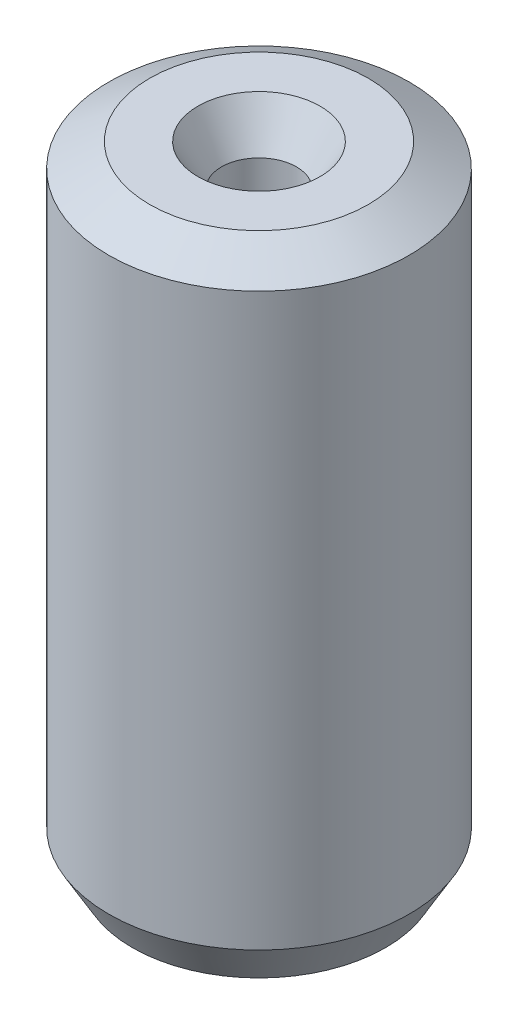
ISO-10303-21;
HEADER;
FILE_DESCRIPTION(('STEP AP214'),'2;1');
FILE_NAME('part.step','',(''),(''),'','','');
FILE_SCHEMA(('AUTOMOTIVE_DESIGN { 1 0 10303 214 1 1 1 1 }'));
ENDSEC;
DATA;
#1=APPLICATION_CONTEXT('core data for automotive mechanical design processes');
#2=APPLICATION_PROTOCOL_DEFINITION('international standard','automotive_design',2000,#1);
#3=PRODUCT_CONTEXT('',#1,'mechanical');
#4=PRODUCT('Part','Part','',(#3));
#5=PRODUCT_RELATED_PRODUCT_CATEGORY('part','',(#4));
#6=PRODUCT_DEFINITION_FORMATION('','',#4);
#7=PRODUCT_DEFINITION_CONTEXT('part definition',#1,'design');
#8=PRODUCT_DEFINITION('design','',#6,#7);
#9=PRODUCT_DEFINITION_SHAPE('','',#8);
#10=(LENGTH_UNIT() NAMED_UNIT(*) SI_UNIT(.MILLI.,.METRE.));
#11=(NAMED_UNIT(*) PLANE_ANGLE_UNIT() SI_UNIT($,.RADIAN.));
#12=(NAMED_UNIT(*) SI_UNIT($,.STERADIAN.) SOLID_ANGLE_UNIT());
#13=UNCERTAINTY_MEASURE_WITH_UNIT(LENGTH_MEASURE(1.E-05),#10,'distance_accuracy_value','');
#14=(GEOMETRIC_REPRESENTATION_CONTEXT(3) GLOBAL_UNCERTAINTY_ASSIGNED_CONTEXT((#13)) GLOBAL_UNIT_ASSIGNED_CONTEXT((#10,
#11,#12)) REPRESENTATION_CONTEXT('',''));
#15=CARTESIAN_POINT('',(0.,0.,0.));
#16=DIRECTION('',(0.,0.,1.));
#17=DIRECTION('',(1.,0.,0.));
#18=AXIS2_PLACEMENT_3D('',#15,#16,#17);
#19=CARTESIAN_POINT('',(0.,21.140414715979,0.));
#20=DIRECTION('',(0.,-1.,0.));
#21=DIRECTION('',(0.,0.,-1.));
#22=AXIS2_PLACEMENT_3D('',#19,#20,#21);
#23=CYLINDRICAL_SURFACE('',#22,5.);
#24=CARTESIAN_POINT('',(0.,1.35913423101517,0.));
#25=DIRECTION('',(0.,1.,0.));
#26=DIRECTION('',(0.,0.,1.));
#27=AXIS2_PLACEMENT_3D('',#24,#25,#26);
#28=CIRCLE('',#27,5.);
#29=CARTESIAN_POINT('',(0.,1.35913423101517,5.));
#30=VERTEX_POINT('',#29);
#31=EDGE_CURVE('E10',#30,#30,#28,.T.);
#32=ORIENTED_EDGE('',*,*,#31,.T.);
#33=EDGE_LOOP('',(#32));
#34=FACE_BOUND('',#33,.T.);
#35=CARTESIAN_POINT('',(0.,20.3557182018375,0.));
#36=DIRECTION('',(0.,1.,0.));
#37=DIRECTION('',(0.,0.,1.));
#38=AXIS2_PLACEMENT_3D('',#35,#36,#37);
#39=CIRCLE('',#38,5.);
#40=CARTESIAN_POINT('',(0.,20.3557182018375,5.));
#41=VERTEX_POINT('',#40);
#42=EDGE_CURVE('E50',#41,#41,#39,.F.);
#43=ORIENTED_EDGE('',*,*,#42,.T.);
#44=EDGE_LOOP('',(#43));
#45=FACE_BOUND('',#44,.T.);
#46=ADVANCED_FACE('F39',(#34,#45),#23,.T.);
#47=CARTESIAN_POINT('',(0.,21.140414715979,0.));
#48=DIRECTION('',(0.,1.,0.));
#49=DIRECTION('',(0.,0.,1.));
#50=AXIS2_PLACEMENT_3D('',#47,#48,#49);
#51=PLANE('',#50);
#52=CARTESIAN_POINT('',(0.,21.140414715979,0.));
#53=DIRECTION('',(0.,1.,0.));
#54=DIRECTION('',(0.,0.,1.));
#55=AXIS2_PLACEMENT_3D('',#52,#53,#54);
#56=CIRCLE('',#55,2.03417617700209);
#57=CARTESIAN_POINT('',(0.,21.140414715979,2.03417617700209));
#58=VERTEX_POINT('',#57);
#59=EDGE_CURVE('E58',#58,#58,#56,.F.);
#60=ORIENTED_EDGE('',*,*,#59,.T.);
#61=EDGE_LOOP('',(#60));
#62=FACE_BOUND('',#61,.T.);
#63=CARTESIAN_POINT('',(0.,21.140414715979,0.));
#64=DIRECTION('',(0.,1.,0.));
#65=DIRECTION('',(0.,0.,1.));
#66=AXIS2_PLACEMENT_3D('',#63,#64,#65);
#67=CIRCLE('',#66,3.64086576898482);
#68=CARTESIAN_POINT('',(0.,21.140414715979,3.64086576898482));
#69=VERTEX_POINT('',#68);
#70=EDGE_CURVE('E61',#69,#69,#67,.T.);
#71=ORIENTED_EDGE('',*,*,#70,.T.);
#72=EDGE_LOOP('',(#71));
#73=FACE_BOUND('',#72,.T.);
#74=ADVANCED_FACE('F88',(#62,#73),#51,.T.);
#75=CARTESIAN_POINT('',(0.,0.,0.));
#76=DIRECTION('',(0.,1.,0.));
#77=DIRECTION('',(0.,0.,1.));
#78=AXIS2_PLACEMENT_3D('',#75,#76,#77);
#79=PLANE('',#78);
#80=CARTESIAN_POINT('',(0.,0.,0.));
#81=DIRECTION('',(0.,1.,0.));
#82=DIRECTION('',(0.,0.,1.));
#83=AXIS2_PLACEMENT_3D('',#80,#81,#82);
#84=CIRCLE('',#83,2.60861389387581);
#85=CARTESIAN_POINT('',(0.,0.,-2.60861389387581));
#86=VERTEX_POINT('',#85);
#87=EDGE_CURVE('E51',#86,#86,#84,.T.);
#88=ORIENTED_EDGE('',*,*,#87,.T.);
#89=EDGE_LOOP('',(#88));
#90=FACE_BOUND('',#89,.T.);
#91=CARTESIAN_POINT('',(0.,0.,0.));
#92=DIRECTION('',(0.,1.,0.));
#93=DIRECTION('',(0.,0.,1.));
#94=AXIS2_PLACEMENT_3D('',#91,#92,#93);
#95=CIRCLE('',#94,4.21530348585855);
#96=CARTESIAN_POINT('',(0.,0.,4.21530348585855));
#97=VERTEX_POINT('',#96);
#98=EDGE_CURVE('E54',#97,#97,#95,.F.);
#99=ORIENTED_EDGE('',*,*,#98,.T.);
#100=EDGE_LOOP('',(#99));
#101=FACE_BOUND('',#100,.T.);
#102=ADVANCED_FACE('F83',(#90,#101),#79,.F.);
#103=CARTESIAN_POINT('',(0.,21.140414715979,0.));
#104=DIRECTION('',(0.,-1.,0.));
#105=DIRECTION('',(0.,0.,-1.));
#106=AXIS2_PLACEMENT_3D('',#103,#104,#105);
#107=CYLINDRICAL_SURFACE('',#106,1.24947966286064);
#108=CARTESIAN_POINT('',(0.,19.7812804849638,0.));
#109=DIRECTION('',(0.,1.,0.));
#110=DIRECTION('',(0.,0.,1.));
#111=AXIS2_PLACEMENT_3D('',#108,#109,#110);
#112=CIRCLE('',#111,1.24947966286064);
#113=CARTESIAN_POINT('',(0.,19.7812804849638,1.24947966286064));
#114=VERTEX_POINT('',#113);
#115=EDGE_CURVE('E67',#114,#114,#112,.T.);
#116=ORIENTED_EDGE('',*,*,#115,.T.);
#117=EDGE_LOOP('',(#116));
#118=FACE_BOUND('',#117,.T.);
#119=CARTESIAN_POINT('',(0.,0.784696514141453,0.));
#120=DIRECTION('',(0.,1.,0.));
#121=DIRECTION('',(0.,0.,1.));
#122=AXIS2_PLACEMENT_3D('',#119,#120,#121);
#123=CIRCLE('',#122,1.24947966286064);
#124=CARTESIAN_POINT('',(0.,0.784696514141453,-1.24947966286064));
#125=VERTEX_POINT('',#124);
#126=EDGE_CURVE('E69',#125,#125,#123,.F.);
#127=ORIENTED_EDGE('',*,*,#126,.T.);
#128=EDGE_LOOP('',(#127));
#129=FACE_BOUND('',#128,.T.);
#130=ADVANCED_FACE('F71',(#118,#129),#107,.F.);
#131=CARTESIAN_POINT('',(0.,19.7812804849638,0.));
#132=DIRECTION('',(0.,1.,0.));
#133=DIRECTION('',(0.,0.,1.));
#134=AXIS2_PLACEMENT_3D('',#131,#132,#133);
#135=CONICAL_SURFACE('',#134,1.24947966286064,0.523598775598304);
#136=ORIENTED_EDGE('',*,*,#59,.F.);
#137=EDGE_LOOP('',(#136));
#138=FACE_BOUND('',#137,.T.);
#139=ORIENTED_EDGE('',*,*,#115,.F.);
#140=EDGE_LOOP('',(#139));
#141=FACE_BOUND('',#140,.T.);
#142=ADVANCED_FACE('F77',(#138,#141),#135,.F.);
#143=CARTESIAN_POINT('',(0.,0.,0.));
#144=DIRECTION('',(0.,-1.,0.));
#145=DIRECTION('',(0.,0.,-1.));
#146=AXIS2_PLACEMENT_3D('',#143,#144,#145);
#147=CONICAL_SURFACE('',#146,2.60861389387581,1.04719755119659);
#148=CARTESIAN_POINT('',(0.,0.784696514141453,-1.24947966286064));
#149=CARTESIAN_POINT('',(0.,0.776522592119146,-1.26363731110038));
#150=CARTESIAN_POINT('',(0.,0.768348670096839,-1.27779495934012));
#151=CARTESIAN_POINT('',(0.,0.752000826052226,-1.3061102558196));
#152=CARTESIAN_POINT('',(0.,0.743826904029919,-1.32026790405934));
#153=CARTESIAN_POINT('',(0.,0.727479059985305,-1.34858320053883));
#154=CARTESIAN_POINT('',(0.,0.719305137962999,-1.36274084877857));
#155=CARTESIAN_POINT('',(0.,0.702957293918385,-1.39105614525805));
#156=CARTESIAN_POINT('',(0.,0.694783371896078,-1.40521379349779));
#157=CARTESIAN_POINT('',(0.,0.678435527851464,-1.43352908997728));
#158=CARTESIAN_POINT('',(0.,0.670261605829158,-1.44768673821702));
#159=CARTESIAN_POINT('',(0.,0.653913761784544,-1.4760020346965));
#160=CARTESIAN_POINT('',(0.,0.645739839762237,-1.49015968293624));
#161=CARTESIAN_POINT('',(0.,0.629391995717624,-1.51847497941572));
#162=CARTESIAN_POINT('',(0.,0.621218073695317,-1.53263262765546));
#163=CARTESIAN_POINT('',(0.,0.604870229650703,-1.56094792413495));
#164=CARTESIAN_POINT('',(0.,0.596696307628396,-1.57510557237469));
#165=CARTESIAN_POINT('',(0.,0.580348463583783,-1.60342086885417));
#166=CARTESIAN_POINT('',(0.,0.572174541561476,-1.61757851709391));
#167=CARTESIAN_POINT('',(0.,0.555826697516862,-1.6458938135734));
#168=CARTESIAN_POINT('',(0.,0.547652775494556,-1.66005146181314));
#169=CARTESIAN_POINT('',(0.,0.531304931449942,-1.68836675829262));
#170=CARTESIAN_POINT('',(0.,0.523131009427635,-1.70252440653236));
#171=CARTESIAN_POINT('',(0.,0.506783165383022,-1.73083970301184));
#172=CARTESIAN_POINT('',(0.,0.498609243360715,-1.74499735125159));
#173=CARTESIAN_POINT('',(0.,0.482261399316101,-1.77331264773107));
#174=CARTESIAN_POINT('',(0.,0.474087477293794,-1.78747029597081));
#175=CARTESIAN_POINT('',(0.,0.457739633249181,-1.81578559245029));
#176=CARTESIAN_POINT('',(0.,0.449565711226874,-1.82994324069003));
#177=CARTESIAN_POINT('',(0.,0.43321786718226,-1.85825853716952));
#178=CARTESIAN_POINT('',(0.,0.425043945159954,-1.87241618540926));
#179=CARTESIAN_POINT('',(0.,0.40869610111534,-1.90073148188874));
#180=CARTESIAN_POINT('',(0.,0.400522179093033,-1.91488913012848));
#181=CARTESIAN_POINT('',(0.,0.38417433504842,-1.94320442660797));
#182=CARTESIAN_POINT('',(0.,0.376000413026113,-1.95736207484771));
#183=CARTESIAN_POINT('',(0.,0.359652568981499,-1.98567737132719));
#184=CARTESIAN_POINT('',(0.,0.351478646959192,-1.99983501956693));
#185=CARTESIAN_POINT('',(0.,0.335130802914579,-2.02815031604641));
#186=CARTESIAN_POINT('',(0.,0.326956880892272,-2.04230796428616));
#187=CARTESIAN_POINT('',(0.,0.310609036847658,-2.07062326076564));
#188=CARTESIAN_POINT('',(0.,0.302435114825352,-2.08478090900538));
#189=CARTESIAN_POINT('',(0.,0.286087270780738,-2.11309620548486));
#190=CARTESIAN_POINT('',(0.,0.277913348758431,-2.1272538537246));
#191=CARTESIAN_POINT('',(0.,0.261565504713818,-2.15556915020409));
#192=CARTESIAN_POINT('',(0.,0.253391582691511,-2.16972679844383));
#193=CARTESIAN_POINT('',(0.,0.237043738646897,-2.19804209492331));
#194=CARTESIAN_POINT('',(0.,0.22886981662459,-2.21219974316305));
#195=CARTESIAN_POINT('',(0.,0.212521972579977,-2.24051503964254));
#196=CARTESIAN_POINT('',(0.,0.20434805055767,-2.25467268788228));
#197=CARTESIAN_POINT('',(0.,0.188000206513056,-2.28298798436176));
#198=CARTESIAN_POINT('',(0.,0.17982628449075,-2.2971456326015));
#199=CARTESIAN_POINT('',(0.,0.163478440446136,-2.32546092908098));
#200=CARTESIAN_POINT('',(0.,0.155304518423829,-2.33961857732073));
#201=CARTESIAN_POINT('',(0.,0.138956674379216,-2.36793387380021));
#202=CARTESIAN_POINT('',(0.,0.130782752356909,-2.38209152203995));
#203=CARTESIAN_POINT('',(0.,0.114434908312295,-2.41040681851943));
#204=CARTESIAN_POINT('',(0.,0.106260986289988,-2.42456446675917));
#205=CARTESIAN_POINT('',(0.,0.0899131422453748,-2.45287976323866));
#206=CARTESIAN_POINT('',(0.,0.081739220223068,-2.4670374114784));
#207=CARTESIAN_POINT('',(0.,0.0653913761784544,-2.49535270795788));
#208=CARTESIAN_POINT('',(0.,0.0572174541561476,-2.50951035619762));
#209=CARTESIAN_POINT('',(0.,0.040869610111534,-2.53782565267711));
#210=CARTESIAN_POINT('',(0.,0.0326956880892272,-2.55198330091685));
#211=CARTESIAN_POINT('',(0.,0.0163478440446136,-2.58029859739633));
#212=CARTESIAN_POINT('',(0.,0.0081739220223068,-2.59445624563607));
#213=CARTESIAN_POINT('',(0.,0.,-2.60861389387581));
#214=B_SPLINE_CURVE_WITH_KNOTS('',3,(#148,#149,#150,#151,#152,#153,#154,#155,#156,#157,#158,
#159,#160,#161,#162,#163,#164,#165,#166,#167,#168,#169,#170,#171,#172,#173,#174,#175,#176,#177,
#178,#179,#180,#181,#182,#183,#184,#185,#186,#187,#188,#189,#190,#191,#192,#193,#194,#195,#196,
#197,#198,#199,#200,#201,#202,#203,#204,#205,#206,#207,#208,#209,#210,#211,#212,#213),
.UNSPECIFIED.,.F.,.F.,(4,2,2,2,2,2,2,2,2,2,2,2,2,2,2,2,2,2,2,2,2,2,2,2,2,2,2,2,2,2,2,2,4),(0.,
0.0490435321338406,0.0980870642676811,0.147130596401522,0.196174128535362,0.245217660669203,
0.294261192803043,0.343304724936884,0.392348257070724,0.441391789204565,0.490435321338405,
0.539478853472246,0.588522385606086,0.637565917739927,0.686609449873768,0.735652982007608,
0.784696514141449,0.833740046275289,0.88278357840913,0.931827110542971,0.980870642676811,
1.02991417481065,1.07895770694449,1.12800123907833,1.17704477121217,1.22608830334601,
1.27513183547985,1.3241753676137,1.37321889974754,1.42226243188138,1.47130596401522,
1.52034949614906,1.5693930282829),.UNSPECIFIED.);
#215=EDGE_CURVE('BSEAM73',#125,#86,#214,.T.);
#216=ORIENTED_EDGE('',*,*,#126,.F.);
#217=ORIENTED_EDGE('',*,*,#87,.F.);
#218=ORIENTED_EDGE('',*,*,#215,.T.);
#219=ORIENTED_EDGE('',*,*,#215,.F.);
#220=EDGE_LOOP('',(#216,#218,#217,#219));
#221=FACE_BOUND('',#220,.T.);
#222=ADVANCED_FACE('F73',(#221),#147,.F.);
#223=CARTESIAN_POINT('',(0.,1.35913423101517,0.));
#224=DIRECTION('',(0.,1.,0.));
#225=DIRECTION('',(0.,0.,1.));
#226=AXIS2_PLACEMENT_3D('',#223,#224,#225);
#227=CONICAL_SURFACE('',#226,5.,0.523598775598303);
#228=ORIENTED_EDGE('',*,*,#98,.F.);
#229=EDGE_LOOP('',(#228));
#230=FACE_BOUND('',#229,.T.);
#231=ORIENTED_EDGE('',*,*,#31,.F.);
#232=EDGE_LOOP('',(#231));
#233=FACE_BOUND('',#232,.T.);
#234=ADVANCED_FACE('F76',(#230,#233),#227,.T.);
#235=CARTESIAN_POINT('',(0.,21.140414715979,0.));
#236=DIRECTION('',(0.,-1.,0.));
#237=DIRECTION('',(0.,0.,-1.));
#238=AXIS2_PLACEMENT_3D('',#235,#236,#237);
#239=CONICAL_SURFACE('',#238,3.64086576898482,1.04719755119659);
#240=ORIENTED_EDGE('',*,*,#42,.F.);
#241=EDGE_LOOP('',(#240));
#242=FACE_BOUND('',#241,.T.);
#243=ORIENTED_EDGE('',*,*,#70,.F.);
#244=EDGE_LOOP('',(#243));
#245=FACE_BOUND('',#244,.T.);
#246=ADVANCED_FACE('F45',(#242,#245),#239,.T.);
#247=CLOSED_SHELL('',(#46,#74,#102,#130,#142,#222,#234,#246));
#248=MANIFOLD_SOLID_BREP('B2',#247);
#249=ADVANCED_BREP_SHAPE_REPRESENTATION('',(#18,#248),#14);
#250=SHAPE_DEFINITION_REPRESENTATION(#9,#249);
ENDSEC;
END-ISO-10303-21;
